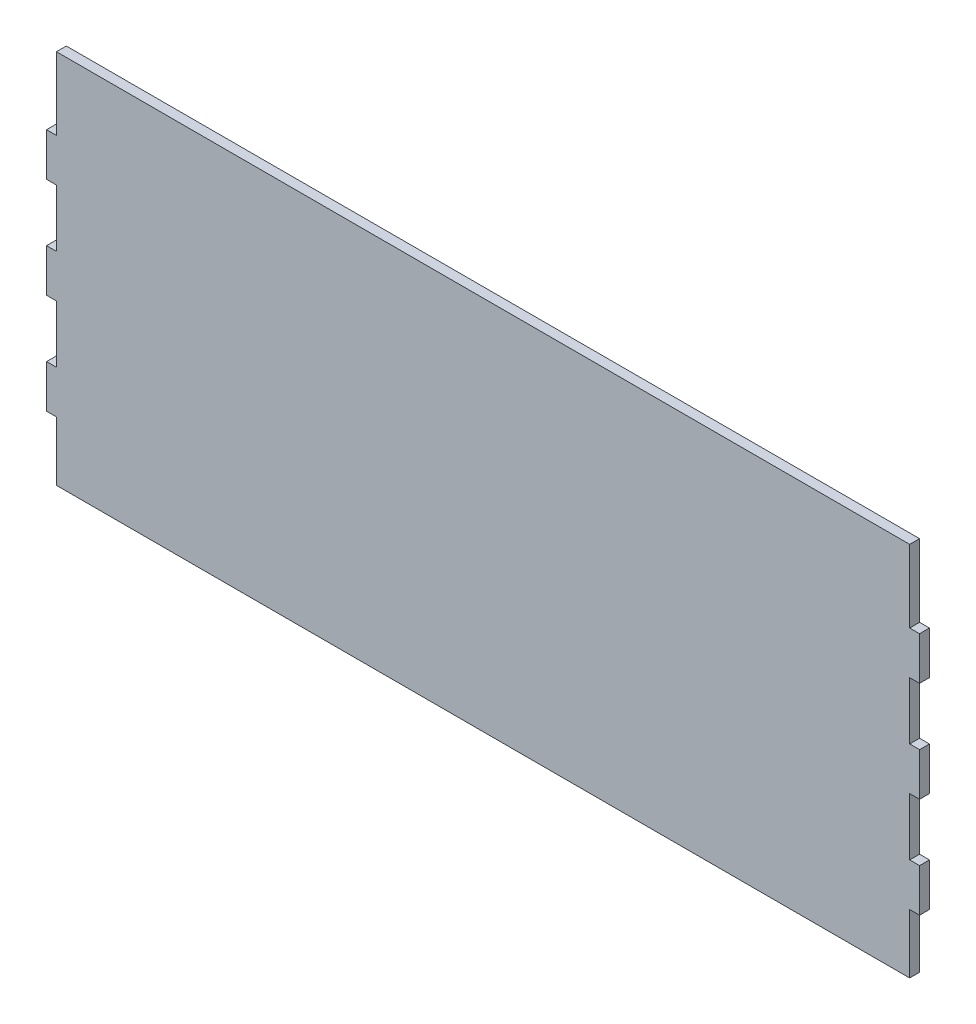
ISO-10303-21;
HEADER;
FILE_DESCRIPTION(('STEP AP214'),'2;1');
FILE_NAME('part.step','',(''),(''),'','','');
FILE_SCHEMA(('AUTOMOTIVE_DESIGN { 1 0 10303 214 1 1 1 1 }'));
ENDSEC;
DATA;
#1=APPLICATION_CONTEXT('core data for automotive mechanical design processes');
#2=APPLICATION_PROTOCOL_DEFINITION('international standard','automotive_design',2000,#1);
#3=PRODUCT_CONTEXT('',#1,'mechanical');
#4=PRODUCT('Part','Part','',(#3));
#5=PRODUCT_RELATED_PRODUCT_CATEGORY('part','',(#4));
#6=PRODUCT_DEFINITION_FORMATION('','',#4);
#7=PRODUCT_DEFINITION_CONTEXT('part definition',#1,'design');
#8=PRODUCT_DEFINITION('design','',#6,#7);
#9=PRODUCT_DEFINITION_SHAPE('','',#8);
#10=(LENGTH_UNIT() NAMED_UNIT(*) SI_UNIT(.MILLI.,.METRE.));
#11=(NAMED_UNIT(*) PLANE_ANGLE_UNIT() SI_UNIT($,.RADIAN.));
#12=(NAMED_UNIT(*) SI_UNIT($,.STERADIAN.) SOLID_ANGLE_UNIT());
#13=UNCERTAINTY_MEASURE_WITH_UNIT(LENGTH_MEASURE(1.E-05),#10,'distance_accuracy_value','');
#14=(GEOMETRIC_REPRESENTATION_CONTEXT(3) GLOBAL_UNCERTAINTY_ASSIGNED_CONTEXT((#13)) GLOBAL_UNIT_ASSIGNED_CONTEXT((#10,
#11,#12)) REPRESENTATION_CONTEXT('',''));
#15=CARTESIAN_POINT('',(0.,0.,0.));
#16=DIRECTION('',(0.,0.,1.));
#17=DIRECTION('',(1.,0.,0.));
#18=AXIS2_PLACEMENT_3D('',#15,#16,#17);
#19=CARTESIAN_POINT('',(132.5,55.,3.));
#20=DIRECTION('',(-1.,0.,0.));
#21=DIRECTION('',(0.,-1.,0.));
#22=AXIS2_PLACEMENT_3D('',#19,#20,#21);
#23=PLANE('',#22);
#24=DIRECTION('',(0.,0.,1.));
#25=VECTOR('',#24,1.);
#26=CARTESIAN_POINT('',(132.5,-23.9518056222649,0.));
#27=LINE('',#26,#25);
#28=CARTESIAN_POINT('',(132.5,-23.9518056222649,0.));
#29=VERTEX_POINT('',#28);
#30=CARTESIAN_POINT('',(132.5,-23.9518056222649,3.));
#31=VERTEX_POINT('',#30);
#32=EDGE_CURVE('E358',#29,#31,#27,.T.);
#33=ORIENTED_EDGE('',*,*,#32,.T.);
#34=DIRECTION('',(0.,1.,0.));
#35=VECTOR('',#34,1.);
#36=CARTESIAN_POINT('',(132.5,55.,3.));
#37=LINE('',#36,#35);
#38=CARTESIAN_POINT('',(132.5,-37.,3.));
#39=VERTEX_POINT('',#38);
#40=EDGE_CURVE('E412',#39,#31,#37,.T.);
#41=ORIENTED_EDGE('',*,*,#40,.F.);
#42=DIRECTION('',(0.,0.,1.));
#43=VECTOR('',#42,1.);
#44=CARTESIAN_POINT('',(132.5,-37.,0.));
#45=LINE('',#44,#43);
#46=CARTESIAN_POINT('',(132.5,-37.,0.));
#47=VERTEX_POINT('',#46);
#48=EDGE_CURVE('E286',#47,#39,#45,.T.);
#49=ORIENTED_EDGE('',*,*,#48,.F.);
#50=DIRECTION('',(0.,1.,0.));
#51=VECTOR('',#50,1.);
#52=CARTESIAN_POINT('',(132.5,55.,0.));
#53=LINE('',#52,#51);
#54=EDGE_CURVE('E419',#47,#29,#53,.T.);
#55=ORIENTED_EDGE('',*,*,#54,.T.);
#56=EDGE_LOOP('',(#33,#41,#49,#55));
#57=FACE_BOUND('',#56,.T.);
#58=ADVANCED_FACE('F38',(#57),#23,.F.);
#59=CARTESIAN_POINT('',(132.5,-6.52409718886751,3.));
#60=VERTEX_POINT('',#59);
#61=CARTESIAN_POINT('',(132.5,6.52409718886757,3.));
#62=VERTEX_POINT('',#61);
#63=EDGE_CURVE('E411',#60,#62,#37,.T.);
#64=ORIENTED_EDGE('',*,*,#63,.F.);
#65=DIRECTION('',(0.,0.,1.));
#66=VECTOR('',#65,1.);
#67=CARTESIAN_POINT('',(132.5,-6.52409718886751,0.));
#68=LINE('',#67,#66);
#69=CARTESIAN_POINT('',(132.5,-6.52409718886751,0.));
#70=VERTEX_POINT('',#69);
#71=EDGE_CURVE('E356',#70,#60,#68,.T.);
#72=ORIENTED_EDGE('',*,*,#71,.F.);
#73=CARTESIAN_POINT('',(132.5,6.52409718886757,0.));
#74=VERTEX_POINT('',#73);
#75=EDGE_CURVE('E418',#70,#74,#53,.T.);
#76=ORIENTED_EDGE('',*,*,#75,.T.);
#77=DIRECTION('',(0.,0.,1.));
#78=VECTOR('',#77,1.);
#79=CARTESIAN_POINT('',(132.5,6.52409718886757,0.));
#80=LINE('',#79,#78);
#81=EDGE_CURVE('E335',#74,#62,#80,.T.);
#82=ORIENTED_EDGE('',*,*,#81,.T.);
#83=EDGE_LOOP('',(#64,#72,#76,#82));
#84=FACE_BOUND('',#83,.T.);
#85=ADVANCED_FACE('F521',(#84),#23,.F.);
#86=CARTESIAN_POINT('',(132.5,23.951805622265,3.));
#87=VERTEX_POINT('',#86);
#88=CARTESIAN_POINT('',(132.5,37.,3.));
#89=VERTEX_POINT('',#88);
#90=EDGE_CURVE('E408',#87,#89,#37,.T.);
#91=ORIENTED_EDGE('',*,*,#90,.F.);
#92=DIRECTION('',(0.,0.,1.));
#93=VECTOR('',#92,1.);
#94=CARTESIAN_POINT('',(132.5,23.951805622265,0.));
#95=LINE('',#94,#93);
#96=CARTESIAN_POINT('',(132.5,23.951805622265,0.));
#97=VERTEX_POINT('',#96);
#98=EDGE_CURVE('E333',#97,#87,#95,.T.);
#99=ORIENTED_EDGE('',*,*,#98,.F.);
#100=CARTESIAN_POINT('',(132.5,37.,0.));
#101=VERTEX_POINT('',#100);
#102=EDGE_CURVE('E406',#97,#101,#53,.T.);
#103=ORIENTED_EDGE('',*,*,#102,.T.);
#104=DIRECTION('',(0.,0.,1.));
#105=VECTOR('',#104,1.);
#106=CARTESIAN_POINT('',(132.5,37.,0.));
#107=LINE('',#106,#105);
#108=EDGE_CURVE('E375',#101,#89,#107,.T.);
#109=ORIENTED_EDGE('',*,*,#108,.T.);
#110=EDGE_LOOP('',(#91,#99,#103,#109));
#111=FACE_BOUND('',#110,.T.);
#112=ADVANCED_FACE('F503',(#111),#23,.F.);
#113=CARTESIAN_POINT('',(-132.5,55.,3.));
#114=DIRECTION('',(1.,0.,0.));
#115=DIRECTION('',(0.,0.,-1.));
#116=AXIS2_PLACEMENT_3D('',#113,#114,#115);
#117=PLANE('',#116);
#118=DIRECTION('',(0.,0.,1.));
#119=VECTOR('',#118,1.);
#120=CARTESIAN_POINT('',(-132.5,23.951805622265,0.));
#121=LINE('',#120,#119);
#122=CARTESIAN_POINT('',(-132.5,23.951805622265,0.));
#123=VERTEX_POINT('',#122);
#124=CARTESIAN_POINT('',(-132.5,23.951805622265,3.));
#125=VERTEX_POINT('',#124);
#126=EDGE_CURVE('E383',#123,#125,#121,.T.);
#127=ORIENTED_EDGE('',*,*,#126,.T.);
#128=DIRECTION('',(0.,-1.,0.));
#129=VECTOR('',#128,1.);
#130=CARTESIAN_POINT('',(-132.5,55.,3.));
#131=LINE('',#130,#129);
#132=CARTESIAN_POINT('',(-132.5,37.,3.));
#133=VERTEX_POINT('',#132);
#134=EDGE_CURVE('E46',#133,#125,#131,.T.);
#135=ORIENTED_EDGE('',*,*,#134,.F.);
#136=DIRECTION('',(0.,0.,1.));
#137=VECTOR('',#136,1.);
#138=CARTESIAN_POINT('',(-132.5,37.,0.));
#139=LINE('',#138,#137);
#140=CARTESIAN_POINT('',(-132.5,37.,0.));
#141=VERTEX_POINT('',#140);
#142=EDGE_CURVE('E402',#141,#133,#139,.T.);
#143=ORIENTED_EDGE('',*,*,#142,.F.);
#144=DIRECTION('',(0.,-1.,0.));
#145=VECTOR('',#144,1.);
#146=CARTESIAN_POINT('',(-132.5,55.,0.));
#147=LINE('',#146,#145);
#148=EDGE_CURVE('E423',#141,#123,#147,.T.);
#149=ORIENTED_EDGE('',*,*,#148,.T.);
#150=EDGE_LOOP('',(#127,#135,#143,#149));
#151=FACE_BOUND('',#150,.T.);
#152=ADVANCED_FACE('F491',(#151),#117,.F.);
#153=DIRECTION('',(0.,0.,1.));
#154=VECTOR('',#153,1.);
#155=CARTESIAN_POINT('',(-132.5,-37.,0.));
#156=LINE('',#155,#154);
#157=CARTESIAN_POINT('',(-132.5,-37.,0.));
#158=VERTEX_POINT('',#157);
#159=CARTESIAN_POINT('',(-132.5,-37.,3.));
#160=VERTEX_POINT('',#159);
#161=EDGE_CURVE('E268',#158,#160,#156,.T.);
#162=ORIENTED_EDGE('',*,*,#161,.T.);
#163=CARTESIAN_POINT('',(-132.5,-23.9518056222649,3.));
#164=VERTEX_POINT('',#163);
#165=EDGE_CURVE('E413',#164,#160,#131,.T.);
#166=ORIENTED_EDGE('',*,*,#165,.F.);
#167=DIRECTION('',(0.,0.,1.));
#168=VECTOR('',#167,1.);
#169=CARTESIAN_POINT('',(-132.5,-23.9518056222649,0.));
#170=LINE('',#169,#168);
#171=CARTESIAN_POINT('',(-132.5,-23.9518056222649,0.));
#172=VERTEX_POINT('',#171);
#173=EDGE_CURVE('E307',#172,#164,#170,.T.);
#174=ORIENTED_EDGE('',*,*,#173,.F.);
#175=EDGE_CURVE('E420',#172,#158,#147,.T.);
#176=ORIENTED_EDGE('',*,*,#175,.T.);
#177=EDGE_LOOP('',(#162,#166,#174,#176));
#178=FACE_BOUND('',#177,.T.);
#179=ADVANCED_FACE('F464',(#178),#117,.F.);
#180=CARTESIAN_POINT('',(-132.5,6.52409718886757,3.));
#181=VERTEX_POINT('',#180);
#182=CARTESIAN_POINT('',(-132.5,-6.52409718886751,3.));
#183=VERTEX_POINT('',#182);
#184=EDGE_CURVE('E415',#181,#183,#131,.T.);
#185=ORIENTED_EDGE('',*,*,#184,.F.);
#186=DIRECTION('',(0.,0.,1.));
#187=VECTOR('',#186,1.);
#188=CARTESIAN_POINT('',(-132.5,6.52409718886757,0.));
#189=LINE('',#188,#187);
#190=CARTESIAN_POINT('',(-132.5,6.52409718886757,0.));
#191=VERTEX_POINT('',#190);
#192=EDGE_CURVE('E381',#191,#181,#189,.T.);
#193=ORIENTED_EDGE('',*,*,#192,.F.);
#194=CARTESIAN_POINT('',(-132.5,-6.52409718886751,0.));
#195=VERTEX_POINT('',#194);
#196=EDGE_CURVE('E422',#191,#195,#147,.T.);
#197=ORIENTED_EDGE('',*,*,#196,.T.);
#198=DIRECTION('',(0.,0.,1.));
#199=VECTOR('',#198,1.);
#200=CARTESIAN_POINT('',(-132.5,-6.52409718886751,0.));
#201=LINE('',#200,#199);
#202=EDGE_CURVE('E309',#195,#183,#201,.T.);
#203=ORIENTED_EDGE('',*,*,#202,.T.);
#204=EDGE_LOOP('',(#185,#193,#197,#203));
#205=FACE_BOUND('',#204,.T.);
#206=ADVANCED_FACE('F476',(#205),#117,.F.);
#207=CARTESIAN_POINT('',(-132.5,-55.,3.));
#208=DIRECTION('',(0.,1.,0.));
#209=DIRECTION('',(0.,0.,1.));
#210=AXIS2_PLACEMENT_3D('',#207,#208,#209);
#211=PLANE('',#210);
#212=DIRECTION('',(0.,0.,1.));
#213=VECTOR('',#212,1.);
#214=CARTESIAN_POINT('',(-129.5,-55.,0.));
#215=LINE('',#214,#213);
#216=CARTESIAN_POINT('',(-129.5,-55.,0.));
#217=VERTEX_POINT('',#216);
#218=CARTESIAN_POINT('',(-129.5,-55.,3.));
#219=VERTEX_POINT('',#218);
#220=EDGE_CURVE('E265',#217,#219,#215,.T.);
#221=ORIENTED_EDGE('',*,*,#220,.F.);
#222=DIRECTION('',(1.,0.,0.));
#223=VECTOR('',#222,1.);
#224=CARTESIAN_POINT('',(-132.5,-55.,0.));
#225=LINE('',#224,#223);
#226=CARTESIAN_POINT('',(129.5,-55.,0.));
#227=VERTEX_POINT('',#226);
#228=EDGE_CURVE('E41',#217,#227,#225,.T.);
#229=ORIENTED_EDGE('',*,*,#228,.T.);
#230=DIRECTION('',(0.,0.,1.));
#231=VECTOR('',#230,1.);
#232=CARTESIAN_POINT('',(129.5,-55.,0.));
#233=LINE('',#232,#231);
#234=CARTESIAN_POINT('',(129.5,-55.,3.));
#235=VERTEX_POINT('',#234);
#236=EDGE_CURVE('E278',#227,#235,#233,.T.);
#237=ORIENTED_EDGE('',*,*,#236,.T.);
#238=DIRECTION('',(1.,0.,0.));
#239=VECTOR('',#238,1.);
#240=CARTESIAN_POINT('',(-132.5,-55.,3.));
#241=LINE('',#240,#239);
#242=EDGE_CURVE('E11',#219,#235,#241,.T.);
#243=ORIENTED_EDGE('',*,*,#242,.F.);
#244=EDGE_LOOP('',(#221,#229,#237,#243));
#245=FACE_BOUND('',#244,.T.);
#246=ADVANCED_FACE('F437',(#245),#211,.F.);
#247=CARTESIAN_POINT('',(0.,0.,3.));
#248=DIRECTION('',(0.,0.,1.));
#249=DIRECTION('',(1.,0.,0.));
#250=AXIS2_PLACEMENT_3D('',#247,#248,#249);
#251=PLANE('',#250);
#252=DIRECTION('',(-1.,0.,0.));
#253=VECTOR('',#252,1.);
#254=CARTESIAN_POINT('',(0.,-6.52409718886751,3.));
#255=LINE('',#254,#253);
#256=CARTESIAN_POINT('',(129.5,-6.52409718886751,3.));
#257=VERTEX_POINT('',#256);
#258=EDGE_CURVE('E342',#60,#257,#255,.T.);
#259=ORIENTED_EDGE('',*,*,#258,.F.);
#260=ORIENTED_EDGE('',*,*,#63,.T.);
#261=DIRECTION('',(-1.,0.,0.));
#262=VECTOR('',#261,1.);
#263=CARTESIAN_POINT('',(0.,6.52409718886757,3.));
#264=LINE('',#263,#262);
#265=CARTESIAN_POINT('',(129.5,6.52409718886757,3.));
#266=VERTEX_POINT('',#265);
#267=EDGE_CURVE('E325',#62,#266,#264,.T.);
#268=ORIENTED_EDGE('',*,*,#267,.T.);
#269=DIRECTION('',(0.,1.,0.));
#270=VECTOR('',#269,1.);
#271=CARTESIAN_POINT('',(129.5,0.,3.));
#272=LINE('',#271,#270);
#273=CARTESIAN_POINT('',(129.5,23.951805622265,3.));
#274=VERTEX_POINT('',#273);
#275=EDGE_CURVE('E322',#266,#274,#272,.T.);
#276=ORIENTED_EDGE('',*,*,#275,.T.);
#277=DIRECTION('',(-1.,0.,0.));
#278=VECTOR('',#277,1.);
#279=CARTESIAN_POINT('',(0.,23.951805622265,3.));
#280=LINE('',#279,#278);
#281=EDGE_CURVE('E316',#87,#274,#280,.T.);
#282=ORIENTED_EDGE('',*,*,#281,.F.);
#283=ORIENTED_EDGE('',*,*,#90,.T.);
#284=DIRECTION('',(-1.,0.,0.));
#285=VECTOR('',#284,1.);
#286=CARTESIAN_POINT('',(0.,37.,3.));
#287=LINE('',#286,#285);
#288=CARTESIAN_POINT('',(129.5,37.,3.));
#289=VERTEX_POINT('',#288);
#290=EDGE_CURVE('E390',#89,#289,#287,.T.);
#291=ORIENTED_EDGE('',*,*,#290,.T.);
#292=DIRECTION('',(0.,1.,0.));
#293=VECTOR('',#292,1.);
#294=CARTESIAN_POINT('',(129.5,0.,3.));
#295=LINE('',#294,#293);
#296=CARTESIAN_POINT('',(129.5,59.,3.));
#297=VERTEX_POINT('',#296);
#298=EDGE_CURVE('E248',#289,#297,#295,.T.);
#299=ORIENTED_EDGE('',*,*,#298,.T.);
#300=DIRECTION('',(1.,0.,0.));
#301=VECTOR('',#300,1.);
#302=CARTESIAN_POINT('',(129.5,59.,3.));
#303=LINE('',#302,#301);
#304=CARTESIAN_POINT('',(-129.5,59.,3.));
#305=VERTEX_POINT('',#304);
#306=EDGE_CURVE('E239',#305,#297,#303,.T.);
#307=ORIENTED_EDGE('',*,*,#306,.F.);
#308=DIRECTION('',(0.,-1.,0.));
#309=VECTOR('',#308,1.);
#310=CARTESIAN_POINT('',(-129.5,0.,3.));
#311=LINE('',#310,#309);
#312=CARTESIAN_POINT('',(-129.5,37.,3.));
#313=VERTEX_POINT('',#312);
#314=EDGE_CURVE('E224',#305,#313,#311,.T.);
#315=ORIENTED_EDGE('',*,*,#314,.T.);
#316=DIRECTION('',(1.,0.,0.));
#317=VECTOR('',#316,1.);
#318=CARTESIAN_POINT('',(0.,37.,3.));
#319=LINE('',#318,#317);
#320=EDGE_CURVE('E232',#133,#313,#319,.T.);
#321=ORIENTED_EDGE('',*,*,#320,.F.);
#322=ORIENTED_EDGE('',*,*,#134,.T.);
#323=DIRECTION('',(1.,0.,0.));
#324=VECTOR('',#323,1.);
#325=CARTESIAN_POINT('',(0.,23.951805622265,3.));
#326=LINE('',#325,#324);
#327=CARTESIAN_POINT('',(-129.5,23.951805622265,3.));
#328=VERTEX_POINT('',#327);
#329=EDGE_CURVE('E374',#125,#328,#326,.T.);
#330=ORIENTED_EDGE('',*,*,#329,.T.);
#331=DIRECTION('',(0.,-1.,0.));
#332=VECTOR('',#331,1.);
#333=CARTESIAN_POINT('',(-129.5,0.,3.));
#334=LINE('',#333,#332);
#335=CARTESIAN_POINT('',(-129.5,6.52409718886757,3.));
#336=VERTEX_POINT('',#335);
#337=EDGE_CURVE('E371',#328,#336,#334,.T.);
#338=ORIENTED_EDGE('',*,*,#337,.T.);
#339=DIRECTION('',(1.,0.,0.));
#340=VECTOR('',#339,1.);
#341=CARTESIAN_POINT('',(0.,6.52409718886757,3.));
#342=LINE('',#341,#340);
#343=EDGE_CURVE('E365',#181,#336,#342,.T.);
#344=ORIENTED_EDGE('',*,*,#343,.F.);
#345=ORIENTED_EDGE('',*,*,#184,.T.);
#346=DIRECTION('',(1.,0.,0.));
#347=VECTOR('',#346,1.);
#348=CARTESIAN_POINT('',(0.,-6.52409718886751,3.));
#349=LINE('',#348,#347);
#350=CARTESIAN_POINT('',(-129.5,-6.52409718886751,3.));
#351=VERTEX_POINT('',#350);
#352=EDGE_CURVE('E301',#183,#351,#349,.T.);
#353=ORIENTED_EDGE('',*,*,#352,.T.);
#354=DIRECTION('',(0.,-1.,0.));
#355=VECTOR('',#354,1.);
#356=CARTESIAN_POINT('',(-129.5,0.,3.));
#357=LINE('',#356,#355);
#358=CARTESIAN_POINT('',(-129.5,-23.9518056222649,3.));
#359=VERTEX_POINT('',#358);
#360=EDGE_CURVE('E267',#351,#359,#357,.T.);
#361=ORIENTED_EDGE('',*,*,#360,.T.);
#362=DIRECTION('',(1.,0.,0.));
#363=VECTOR('',#362,1.);
#364=CARTESIAN_POINT('',(0.,-23.9518056222649,3.));
#365=LINE('',#364,#363);
#366=EDGE_CURVE('E293',#164,#359,#365,.T.);
#367=ORIENTED_EDGE('',*,*,#366,.F.);
#368=ORIENTED_EDGE('',*,*,#165,.T.);
#369=DIRECTION('',(1.,0.,0.));
#370=VECTOR('',#369,1.);
#371=CARTESIAN_POINT('',(0.,-37.,3.));
#372=LINE('',#371,#370);
#373=CARTESIAN_POINT('',(-129.5,-37.,3.));
#374=VERTEX_POINT('',#373);
#375=EDGE_CURVE('E258',#160,#374,#372,.T.);
#376=ORIENTED_EDGE('',*,*,#375,.T.);
#377=DIRECTION('',(0.,-1.,0.));
#378=VECTOR('',#377,1.);
#379=CARTESIAN_POINT('',(-129.5,0.,3.));
#380=LINE('',#379,#378);
#381=EDGE_CURVE('E253',#374,#219,#380,.T.);
#382=ORIENTED_EDGE('',*,*,#381,.T.);
#383=ORIENTED_EDGE('',*,*,#242,.T.);
#384=DIRECTION('',(0.,1.,0.));
#385=VECTOR('',#384,1.);
#386=CARTESIAN_POINT('',(129.5,-7.1886940844479E-13,3.));
#387=LINE('',#386,#385);
#388=CARTESIAN_POINT('',(129.5,-37.,3.));
#389=VERTEX_POINT('',#388);
#390=EDGE_CURVE('E279',#235,#389,#387,.T.);
#391=ORIENTED_EDGE('',*,*,#390,.T.);
#392=DIRECTION('',(-1.,0.,0.));
#393=VECTOR('',#392,1.);
#394=CARTESIAN_POINT('',(0.,-37.,3.));
#395=LINE('',#394,#393);
#396=EDGE_CURVE('E275',#39,#389,#395,.T.);
#397=ORIENTED_EDGE('',*,*,#396,.F.);
#398=ORIENTED_EDGE('',*,*,#40,.T.);
#399=DIRECTION('',(-1.,0.,0.));
#400=VECTOR('',#399,1.);
#401=CARTESIAN_POINT('',(0.,-23.9518056222649,3.));
#402=LINE('',#401,#400);
#403=CARTESIAN_POINT('',(129.5,-23.9518056222649,3.));
#404=VERTEX_POINT('',#403);
#405=EDGE_CURVE('E350',#31,#404,#402,.T.);
#406=ORIENTED_EDGE('',*,*,#405,.T.);
#407=DIRECTION('',(0.,1.,0.));
#408=VECTOR('',#407,1.);
#409=CARTESIAN_POINT('',(129.5,0.,3.));
#410=LINE('',#409,#408);
#411=EDGE_CURVE('E285',#404,#257,#410,.T.);
#412=ORIENTED_EDGE('',*,*,#411,.T.);
#413=EDGE_LOOP('',(#259,#260,#268,#276,#282,#283,#291,#299,#307,#315,#321,#322,#330,#338,#344,
#345,#353,#361,#367,#368,#376,#382,#383,#391,#397,#398,#406,#412));
#414=FACE_BOUND('',#413,.T.);
#415=ADVANCED_FACE('F245',(#414),#251,.T.);
#416=CARTESIAN_POINT('',(0.,0.,0.));
#417=DIRECTION('',(0.,0.,1.));
#418=DIRECTION('',(1.,0.,0.));
#419=AXIS2_PLACEMENT_3D('',#416,#417,#418);
#420=PLANE('',#419);
#421=ORIENTED_EDGE('',*,*,#75,.F.);
#422=DIRECTION('',(-1.,0.,0.));
#423=VECTOR('',#422,1.);
#424=CARTESIAN_POINT('',(0.,-6.52409718886751,0.));
#425=LINE('',#424,#423);
#426=CARTESIAN_POINT('',(129.5,-6.52409718886751,0.));
#427=VERTEX_POINT('',#426);
#428=EDGE_CURVE('E344',#70,#427,#425,.T.);
#429=ORIENTED_EDGE('',*,*,#428,.T.);
#430=DIRECTION('',(0.,1.,0.));
#431=VECTOR('',#430,1.);
#432=CARTESIAN_POINT('',(129.5,0.,0.));
#433=LINE('',#432,#431);
#434=CARTESIAN_POINT('',(129.5,-23.9518056222649,0.));
#435=VERTEX_POINT('',#434);
#436=EDGE_CURVE('E339',#435,#427,#433,.T.);
#437=ORIENTED_EDGE('',*,*,#436,.F.);
#438=DIRECTION('',(-1.,0.,0.));
#439=VECTOR('',#438,1.);
#440=CARTESIAN_POINT('',(0.,-23.9518056222649,0.));
#441=LINE('',#440,#439);
#442=EDGE_CURVE('E341',#29,#435,#441,.T.);
#443=ORIENTED_EDGE('',*,*,#442,.F.);
#444=ORIENTED_EDGE('',*,*,#54,.F.);
#445=DIRECTION('',(-1.,0.,0.));
#446=VECTOR('',#445,1.);
#447=CARTESIAN_POINT('',(0.,-37.,0.));
#448=LINE('',#447,#446);
#449=CARTESIAN_POINT('',(129.5,-37.,0.));
#450=VERTEX_POINT('',#449);
#451=EDGE_CURVE('E274',#47,#450,#448,.T.);
#452=ORIENTED_EDGE('',*,*,#451,.T.);
#453=DIRECTION('',(0.,1.,0.));
#454=VECTOR('',#453,1.);
#455=CARTESIAN_POINT('',(129.5,-7.1886940844479E-13,0.));
#456=LINE('',#455,#454);
#457=EDGE_CURVE('E272',#227,#450,#456,.T.);
#458=ORIENTED_EDGE('',*,*,#457,.F.);
#459=ORIENTED_EDGE('',*,*,#228,.F.);
#460=DIRECTION('',(0.,-1.,0.));
#461=VECTOR('',#460,1.);
#462=CARTESIAN_POINT('',(-129.5,0.,0.));
#463=LINE('',#462,#461);
#464=CARTESIAN_POINT('',(-129.5,-37.,0.));
#465=VERTEX_POINT('',#464);
#466=EDGE_CURVE('E255',#465,#217,#463,.T.);
#467=ORIENTED_EDGE('',*,*,#466,.F.);
#468=DIRECTION('',(1.,0.,0.));
#469=VECTOR('',#468,1.);
#470=CARTESIAN_POINT('',(0.,-37.,0.));
#471=LINE('',#470,#469);
#472=EDGE_CURVE('E257',#158,#465,#471,.T.);
#473=ORIENTED_EDGE('',*,*,#472,.F.);
#474=ORIENTED_EDGE('',*,*,#175,.F.);
#475=DIRECTION('',(1.,0.,0.));
#476=VECTOR('',#475,1.);
#477=CARTESIAN_POINT('',(0.,-23.9518056222649,0.));
#478=LINE('',#477,#476);
#479=CARTESIAN_POINT('',(-129.5,-23.9518056222649,0.));
#480=VERTEX_POINT('',#479);
#481=EDGE_CURVE('E295',#172,#480,#478,.T.);
#482=ORIENTED_EDGE('',*,*,#481,.T.);
#483=DIRECTION('',(0.,-1.,0.));
#484=VECTOR('',#483,1.);
#485=CARTESIAN_POINT('',(-129.5,0.,0.));
#486=LINE('',#485,#484);
#487=CARTESIAN_POINT('',(-129.5,-6.52409718886751,0.));
#488=VERTEX_POINT('',#487);
#489=EDGE_CURVE('E290',#488,#480,#486,.T.);
#490=ORIENTED_EDGE('',*,*,#489,.F.);
#491=DIRECTION('',(1.,0.,0.));
#492=VECTOR('',#491,1.);
#493=CARTESIAN_POINT('',(0.,-6.52409718886751,0.));
#494=LINE('',#493,#492);
#495=EDGE_CURVE('E292',#195,#488,#494,.T.);
#496=ORIENTED_EDGE('',*,*,#495,.F.);
#497=ORIENTED_EDGE('',*,*,#196,.F.);
#498=DIRECTION('',(1.,0.,0.));
#499=VECTOR('',#498,1.);
#500=CARTESIAN_POINT('',(0.,6.52409718886757,0.));
#501=LINE('',#500,#499);
#502=CARTESIAN_POINT('',(-129.5,6.52409718886757,0.));
#503=VERTEX_POINT('',#502);
#504=EDGE_CURVE('E367',#191,#503,#501,.T.);
#505=ORIENTED_EDGE('',*,*,#504,.T.);
#506=DIRECTION('',(0.,-1.,0.));
#507=VECTOR('',#506,1.);
#508=CARTESIAN_POINT('',(-129.5,0.,0.));
#509=LINE('',#508,#507);
#510=CARTESIAN_POINT('',(-129.5,23.951805622265,0.));
#511=VERTEX_POINT('',#510);
#512=EDGE_CURVE('E362',#511,#503,#509,.T.);
#513=ORIENTED_EDGE('',*,*,#512,.F.);
#514=DIRECTION('',(1.,0.,0.));
#515=VECTOR('',#514,1.);
#516=CARTESIAN_POINT('',(0.,23.951805622265,0.));
#517=LINE('',#516,#515);
#518=EDGE_CURVE('E364',#123,#511,#517,.T.);
#519=ORIENTED_EDGE('',*,*,#518,.F.);
#520=ORIENTED_EDGE('',*,*,#148,.F.);
#521=DIRECTION('',(1.,0.,0.));
#522=VECTOR('',#521,1.);
#523=CARTESIAN_POINT('',(0.,37.,0.));
#524=LINE('',#523,#522);
#525=CARTESIAN_POINT('',(-129.5,37.,0.));
#526=VERTEX_POINT('',#525);
#527=EDGE_CURVE('E400',#141,#526,#524,.T.);
#528=ORIENTED_EDGE('',*,*,#527,.T.);
#529=DIRECTION('',(0.,-1.,0.));
#530=VECTOR('',#529,1.);
#531=CARTESIAN_POINT('',(-129.5,0.,0.));
#532=LINE('',#531,#530);
#533=CARTESIAN_POINT('',(-129.5,59.,0.));
#534=VERTEX_POINT('',#533);
#535=EDGE_CURVE('E398',#534,#526,#532,.T.);
#536=ORIENTED_EDGE('',*,*,#535,.F.);
#537=DIRECTION('',(1.,0.,0.));
#538=VECTOR('',#537,1.);
#539=CARTESIAN_POINT('',(129.5,59.,0.));
#540=LINE('',#539,#538);
#541=CARTESIAN_POINT('',(129.5,59.,0.));
#542=VERTEX_POINT('',#541);
#543=EDGE_CURVE('E241',#534,#542,#540,.T.);
#544=ORIENTED_EDGE('',*,*,#543,.T.);
#545=DIRECTION('',(0.,1.,0.));
#546=VECTOR('',#545,1.);
#547=CARTESIAN_POINT('',(129.5,0.,0.));
#548=LINE('',#547,#546);
#549=CARTESIAN_POINT('',(129.5,37.,0.));
#550=VERTEX_POINT('',#549);
#551=EDGE_CURVE('E387',#550,#542,#548,.T.);
#552=ORIENTED_EDGE('',*,*,#551,.F.);
#553=DIRECTION('',(-1.,0.,0.));
#554=VECTOR('',#553,1.);
#555=CARTESIAN_POINT('',(0.,37.,0.));
#556=LINE('',#555,#554);
#557=EDGE_CURVE('E389',#101,#550,#556,.T.);
#558=ORIENTED_EDGE('',*,*,#557,.F.);
#559=ORIENTED_EDGE('',*,*,#102,.F.);
#560=DIRECTION('',(-1.,0.,0.));
#561=VECTOR('',#560,1.);
#562=CARTESIAN_POINT('',(0.,23.951805622265,0.));
#563=LINE('',#562,#561);
#564=CARTESIAN_POINT('',(129.5,23.951805622265,0.));
#565=VERTEX_POINT('',#564);
#566=EDGE_CURVE('E318',#97,#565,#563,.T.);
#567=ORIENTED_EDGE('',*,*,#566,.T.);
#568=DIRECTION('',(0.,1.,0.));
#569=VECTOR('',#568,1.);
#570=CARTESIAN_POINT('',(129.5,0.,0.));
#571=LINE('',#570,#569);
#572=CARTESIAN_POINT('',(129.5,6.52409718886757,0.));
#573=VERTEX_POINT('',#572);
#574=EDGE_CURVE('E313',#573,#565,#571,.T.);
#575=ORIENTED_EDGE('',*,*,#574,.F.);
#576=DIRECTION('',(-1.,0.,0.));
#577=VECTOR('',#576,1.);
#578=CARTESIAN_POINT('',(0.,6.52409718886757,0.));
#579=LINE('',#578,#577);
#580=EDGE_CURVE('E315',#74,#573,#579,.T.);
#581=ORIENTED_EDGE('',*,*,#580,.F.);
#582=EDGE_LOOP('',(#421,#429,#437,#443,#444,#452,#458,#459,#467,#473,#474,#482,#490,#496,#497,
#505,#513,#519,#520,#528,#536,#544,#552,#558,#559,#567,#575,#581));
#583=FACE_BOUND('',#582,.T.);
#584=ADVANCED_FACE('F443',(#583),#420,.F.);
#585=CARTESIAN_POINT('',(-129.5,0.,0.));
#586=DIRECTION('',(-1.,0.,0.));
#587=DIRECTION('',(0.,0.,1.));
#588=AXIS2_PLACEMENT_3D('',#585,#586,#587);
#589=PLANE('',#588);
#590=ORIENTED_EDGE('',*,*,#314,.F.);
#591=DIRECTION('',(0.,0.,-1.));
#592=VECTOR('',#591,1.);
#593=CARTESIAN_POINT('',(-129.5,59.,3.));
#594=LINE('',#593,#592);
#595=EDGE_CURVE('E227',#305,#534,#594,.T.);
#596=ORIENTED_EDGE('',*,*,#595,.T.);
#597=ORIENTED_EDGE('',*,*,#535,.T.);
#598=DIRECTION('',(0.,0.,1.));
#599=VECTOR('',#598,1.);
#600=CARTESIAN_POINT('',(-129.5,37.,0.));
#601=LINE('',#600,#599);
#602=EDGE_CURVE('E62',#526,#313,#601,.T.);
#603=ORIENTED_EDGE('',*,*,#602,.T.);
#604=EDGE_LOOP('',(#590,#596,#597,#603));
#605=FACE_BOUND('',#604,.T.);
#606=ADVANCED_FACE('F226',(#605),#589,.T.);
#607=CARTESIAN_POINT('',(0.,37.,0.));
#608=DIRECTION('',(0.,-1.,0.));
#609=DIRECTION('',(0.,0.,-1.));
#610=AXIS2_PLACEMENT_3D('',#607,#608,#609);
#611=PLANE('',#610);
#612=ORIENTED_EDGE('',*,*,#320,.T.);
#613=ORIENTED_EDGE('',*,*,#602,.F.);
#614=ORIENTED_EDGE('',*,*,#527,.F.);
#615=ORIENTED_EDGE('',*,*,#142,.T.);
#616=EDGE_LOOP('',(#612,#613,#614,#615));
#617=FACE_BOUND('',#616,.T.);
#618=ADVANCED_FACE('F492',(#617),#611,.F.);
#619=CARTESIAN_POINT('',(129.5,-7.1886940844479E-13,0.));
#620=DIRECTION('',(1.,0.,0.));
#621=DIRECTION('',(0.,1.,0.));
#622=AXIS2_PLACEMENT_3D('',#619,#620,#621);
#623=PLANE('',#622);
#624=ORIENTED_EDGE('',*,*,#390,.F.);
#625=ORIENTED_EDGE('',*,*,#236,.F.);
#626=ORIENTED_EDGE('',*,*,#457,.T.);
#627=DIRECTION('',(0.,0.,1.));
#628=VECTOR('',#627,1.);
#629=CARTESIAN_POINT('',(129.5,-37.,0.));
#630=LINE('',#629,#628);
#631=EDGE_CURVE('E54',#450,#389,#630,.T.);
#632=ORIENTED_EDGE('',*,*,#631,.T.);
#633=EDGE_LOOP('',(#624,#625,#626,#632));
#634=FACE_BOUND('',#633,.T.);
#635=ADVANCED_FACE('F447',(#634),#623,.T.);
#636=CARTESIAN_POINT('',(0.,-37.,0.));
#637=DIRECTION('',(0.,1.,0.));
#638=DIRECTION('',(0.,0.,1.));
#639=AXIS2_PLACEMENT_3D('',#636,#637,#638);
#640=PLANE('',#639);
#641=ORIENTED_EDGE('',*,*,#396,.T.);
#642=ORIENTED_EDGE('',*,*,#631,.F.);
#643=ORIENTED_EDGE('',*,*,#451,.F.);
#644=ORIENTED_EDGE('',*,*,#48,.T.);
#645=EDGE_LOOP('',(#641,#642,#643,#644));
#646=FACE_BOUND('',#645,.T.);
#647=ADVANCED_FACE('F680',(#646),#640,.F.);
#648=CARTESIAN_POINT('',(-129.5,0.,0.));
#649=DIRECTION('',(-1.,0.,0.));
#650=DIRECTION('',(0.,0.,1.));
#651=AXIS2_PLACEMENT_3D('',#648,#649,#650);
#652=PLANE('',#651);
#653=ORIENTED_EDGE('',*,*,#360,.F.);
#654=DIRECTION('',(0.,0.,1.));
#655=VECTOR('',#654,1.);
#656=CARTESIAN_POINT('',(-129.5,-6.52409718886751,0.));
#657=LINE('',#656,#655);
#658=EDGE_CURVE('E298',#488,#351,#657,.T.);
#659=ORIENTED_EDGE('',*,*,#658,.F.);
#660=ORIENTED_EDGE('',*,*,#489,.T.);
#661=DIRECTION('',(0.,0.,1.));
#662=VECTOR('',#661,1.);
#663=CARTESIAN_POINT('',(-129.5,-23.9518056222649,0.));
#664=LINE('',#663,#662);
#665=EDGE_CURVE('E282',#480,#359,#664,.T.);
#666=ORIENTED_EDGE('',*,*,#665,.T.);
#667=EDGE_LOOP('',(#653,#659,#660,#666));
#668=FACE_BOUND('',#667,.T.);
#669=ADVANCED_FACE('F469',(#668),#652,.T.);
#670=CARTESIAN_POINT('',(0.,-23.9518056222649,0.));
#671=DIRECTION('',(0.,-1.,0.));
#672=DIRECTION('',(0.,0.,-1.));
#673=AXIS2_PLACEMENT_3D('',#670,#671,#672);
#674=PLANE('',#673);
#675=ORIENTED_EDGE('',*,*,#366,.T.);
#676=ORIENTED_EDGE('',*,*,#665,.F.);
#677=ORIENTED_EDGE('',*,*,#481,.F.);
#678=ORIENTED_EDGE('',*,*,#173,.T.);
#679=EDGE_LOOP('',(#675,#676,#677,#678));
#680=FACE_BOUND('',#679,.T.);
#681=ADVANCED_FACE('F461',(#680),#674,.F.);
#682=CARTESIAN_POINT('',(0.,-6.52409718886751,0.));
#683=DIRECTION('',(0.,-1.,0.));
#684=DIRECTION('',(0.,0.,-1.));
#685=AXIS2_PLACEMENT_3D('',#682,#683,#684);
#686=PLANE('',#685);
#687=ORIENTED_EDGE('',*,*,#352,.F.);
#688=ORIENTED_EDGE('',*,*,#202,.F.);
#689=ORIENTED_EDGE('',*,*,#495,.T.);
#690=ORIENTED_EDGE('',*,*,#658,.T.);
#691=EDGE_LOOP('',(#687,#688,#689,#690));
#692=FACE_BOUND('',#691,.T.);
#693=ADVANCED_FACE('F471',(#692),#686,.T.);
#694=CARTESIAN_POINT('',(-129.5,0.,0.));
#695=DIRECTION('',(-1.,0.,0.));
#696=DIRECTION('',(0.,0.,1.));
#697=AXIS2_PLACEMENT_3D('',#694,#695,#696);
#698=PLANE('',#697);
#699=ORIENTED_EDGE('',*,*,#381,.F.);
#700=DIRECTION('',(0.,0.,1.));
#701=VECTOR('',#700,1.);
#702=CARTESIAN_POINT('',(-129.5,-37.,0.));
#703=LINE('',#702,#701);
#704=EDGE_CURVE('E260',#465,#374,#703,.T.);
#705=ORIENTED_EDGE('',*,*,#704,.F.);
#706=ORIENTED_EDGE('',*,*,#466,.T.);
#707=ORIENTED_EDGE('',*,*,#220,.T.);
#708=EDGE_LOOP('',(#699,#705,#706,#707));
#709=FACE_BOUND('',#708,.T.);
#710=ADVANCED_FACE('F454',(#709),#698,.T.);
#711=CARTESIAN_POINT('',(0.,-37.,0.));
#712=DIRECTION('',(0.,-1.,0.));
#713=DIRECTION('',(0.,0.,-1.));
#714=AXIS2_PLACEMENT_3D('',#711,#712,#713);
#715=PLANE('',#714);
#716=ORIENTED_EDGE('',*,*,#375,.F.);
#717=ORIENTED_EDGE('',*,*,#161,.F.);
#718=ORIENTED_EDGE('',*,*,#472,.T.);
#719=ORIENTED_EDGE('',*,*,#704,.T.);
#720=EDGE_LOOP('',(#716,#717,#718,#719));
#721=FACE_BOUND('',#720,.T.);
#722=ADVANCED_FACE('F456',(#721),#715,.T.);
#723=CARTESIAN_POINT('',(-129.5,0.,0.));
#724=DIRECTION('',(-1.,0.,0.));
#725=DIRECTION('',(0.,0.,1.));
#726=AXIS2_PLACEMENT_3D('',#723,#724,#725);
#727=PLANE('',#726);
#728=ORIENTED_EDGE('',*,*,#337,.F.);
#729=DIRECTION('',(0.,0.,1.));
#730=VECTOR('',#729,1.);
#731=CARTESIAN_POINT('',(-129.5,23.951805622265,0.));
#732=LINE('',#731,#730);
#733=EDGE_CURVE('E370',#511,#328,#732,.T.);
#734=ORIENTED_EDGE('',*,*,#733,.F.);
#735=ORIENTED_EDGE('',*,*,#512,.T.);
#736=DIRECTION('',(0.,0.,1.));
#737=VECTOR('',#736,1.);
#738=CARTESIAN_POINT('',(-129.5,6.52409718886757,0.));
#739=LINE('',#738,#737);
#740=EDGE_CURVE('E233',#503,#336,#739,.T.);
#741=ORIENTED_EDGE('',*,*,#740,.T.);
#742=EDGE_LOOP('',(#728,#734,#735,#741));
#743=FACE_BOUND('',#742,.T.);
#744=ADVANCED_FACE('F485',(#743),#727,.T.);
#745=CARTESIAN_POINT('',(0.,6.52409718886757,0.));
#746=DIRECTION('',(0.,-1.,0.));
#747=DIRECTION('',(0.,0.,-1.));
#748=AXIS2_PLACEMENT_3D('',#745,#746,#747);
#749=PLANE('',#748);
#750=ORIENTED_EDGE('',*,*,#343,.T.);
#751=ORIENTED_EDGE('',*,*,#740,.F.);
#752=ORIENTED_EDGE('',*,*,#504,.F.);
#753=ORIENTED_EDGE('',*,*,#192,.T.);
#754=EDGE_LOOP('',(#750,#751,#752,#753));
#755=FACE_BOUND('',#754,.T.);
#756=ADVANCED_FACE('F479',(#755),#749,.F.);
#757=CARTESIAN_POINT('',(0.,23.951805622265,0.));
#758=DIRECTION('',(0.,-1.,0.));
#759=DIRECTION('',(0.,0.,-1.));
#760=AXIS2_PLACEMENT_3D('',#757,#758,#759);
#761=PLANE('',#760);
#762=ORIENTED_EDGE('',*,*,#329,.F.);
#763=ORIENTED_EDGE('',*,*,#126,.F.);
#764=ORIENTED_EDGE('',*,*,#518,.T.);
#765=ORIENTED_EDGE('',*,*,#733,.T.);
#766=EDGE_LOOP('',(#762,#763,#764,#765));
#767=FACE_BOUND('',#766,.T.);
#768=ADVANCED_FACE('F489',(#767),#761,.T.);
#769=CARTESIAN_POINT('',(129.5,0.,0.));
#770=DIRECTION('',(1.,0.,0.));
#771=DIRECTION('',(0.,0.,-1.));
#772=AXIS2_PLACEMENT_3D('',#769,#770,#771);
#773=PLANE('',#772);
#774=ORIENTED_EDGE('',*,*,#298,.F.);
#775=DIRECTION('',(0.,0.,1.));
#776=VECTOR('',#775,1.);
#777=CARTESIAN_POINT('',(129.5,37.,0.));
#778=LINE('',#777,#776);
#779=EDGE_CURVE('E392',#550,#289,#778,.T.);
#780=ORIENTED_EDGE('',*,*,#779,.F.);
#781=ORIENTED_EDGE('',*,*,#551,.T.);
#782=DIRECTION('',(0.,0.,-1.));
#783=VECTOR('',#782,1.);
#784=CARTESIAN_POINT('',(129.5,59.,3.));
#785=LINE('',#784,#783);
#786=EDGE_CURVE('E242',#297,#542,#785,.T.);
#787=ORIENTED_EDGE('',*,*,#786,.F.);
#788=EDGE_LOOP('',(#774,#780,#781,#787));
#789=FACE_BOUND('',#788,.T.);
#790=ADVANCED_FACE('F498',(#789),#773,.T.);
#791=CARTESIAN_POINT('',(0.,37.,0.));
#792=DIRECTION('',(0.,1.,0.));
#793=DIRECTION('',(0.,0.,1.));
#794=AXIS2_PLACEMENT_3D('',#791,#792,#793);
#795=PLANE('',#794);
#796=ORIENTED_EDGE('',*,*,#290,.F.);
#797=ORIENTED_EDGE('',*,*,#108,.F.);
#798=ORIENTED_EDGE('',*,*,#557,.T.);
#799=ORIENTED_EDGE('',*,*,#779,.T.);
#800=EDGE_LOOP('',(#796,#797,#798,#799));
#801=FACE_BOUND('',#800,.T.);
#802=ADVANCED_FACE('F500',(#801),#795,.T.);
#803=CARTESIAN_POINT('',(129.5,0.,0.));
#804=DIRECTION('',(1.,0.,0.));
#805=DIRECTION('',(0.,0.,-1.));
#806=AXIS2_PLACEMENT_3D('',#803,#804,#805);
#807=PLANE('',#806);
#808=ORIENTED_EDGE('',*,*,#275,.F.);
#809=DIRECTION('',(0.,0.,1.));
#810=VECTOR('',#809,1.);
#811=CARTESIAN_POINT('',(129.5,6.52409718886757,0.));
#812=LINE('',#811,#810);
#813=EDGE_CURVE('E321',#573,#266,#812,.T.);
#814=ORIENTED_EDGE('',*,*,#813,.F.);
#815=ORIENTED_EDGE('',*,*,#574,.T.);
#816=DIRECTION('',(0.,0.,1.));
#817=VECTOR('',#816,1.);
#818=CARTESIAN_POINT('',(129.5,23.951805622265,0.));
#819=LINE('',#818,#817);
#820=EDGE_CURVE('E331',#565,#274,#819,.T.);
#821=ORIENTED_EDGE('',*,*,#820,.T.);
#822=EDGE_LOOP('',(#808,#814,#815,#821));
#823=FACE_BOUND('',#822,.T.);
#824=ADVANCED_FACE('F515',(#823),#807,.T.);
#825=CARTESIAN_POINT('',(0.,23.951805622265,0.));
#826=DIRECTION('',(0.,1.,0.));
#827=DIRECTION('',(0.,0.,1.));
#828=AXIS2_PLACEMENT_3D('',#825,#826,#827);
#829=PLANE('',#828);
#830=ORIENTED_EDGE('',*,*,#281,.T.);
#831=ORIENTED_EDGE('',*,*,#820,.F.);
#832=ORIENTED_EDGE('',*,*,#566,.F.);
#833=ORIENTED_EDGE('',*,*,#98,.T.);
#834=EDGE_LOOP('',(#830,#831,#832,#833));
#835=FACE_BOUND('',#834,.T.);
#836=ADVANCED_FACE('F509',(#835),#829,.F.);
#837=CARTESIAN_POINT('',(0.,6.52409718886757,0.));
#838=DIRECTION('',(0.,1.,0.));
#839=DIRECTION('',(0.,0.,1.));
#840=AXIS2_PLACEMENT_3D('',#837,#838,#839);
#841=PLANE('',#840);
#842=ORIENTED_EDGE('',*,*,#267,.F.);
#843=ORIENTED_EDGE('',*,*,#81,.F.);
#844=ORIENTED_EDGE('',*,*,#580,.T.);
#845=ORIENTED_EDGE('',*,*,#813,.T.);
#846=EDGE_LOOP('',(#842,#843,#844,#845));
#847=FACE_BOUND('',#846,.T.);
#848=ADVANCED_FACE('F517',(#847),#841,.T.);
#849=CARTESIAN_POINT('',(129.5,0.,0.));
#850=DIRECTION('',(1.,0.,0.));
#851=DIRECTION('',(0.,0.,-1.));
#852=AXIS2_PLACEMENT_3D('',#849,#850,#851);
#853=PLANE('',#852);
#854=ORIENTED_EDGE('',*,*,#411,.F.);
#855=DIRECTION('',(0.,0.,1.));
#856=VECTOR('',#855,1.);
#857=CARTESIAN_POINT('',(129.5,-23.9518056222649,0.));
#858=LINE('',#857,#856);
#859=EDGE_CURVE('E347',#435,#404,#858,.T.);
#860=ORIENTED_EDGE('',*,*,#859,.F.);
#861=ORIENTED_EDGE('',*,*,#436,.T.);
#862=DIRECTION('',(0.,0.,1.));
#863=VECTOR('',#862,1.);
#864=CARTESIAN_POINT('',(129.5,-6.52409718886751,0.));
#865=LINE('',#864,#863);
#866=EDGE_CURVE('E326',#427,#257,#865,.T.);
#867=ORIENTED_EDGE('',*,*,#866,.T.);
#868=EDGE_LOOP('',(#854,#860,#861,#867));
#869=FACE_BOUND('',#868,.T.);
#870=ADVANCED_FACE('F533',(#869),#853,.T.);
#871=CARTESIAN_POINT('',(0.,-6.52409718886751,0.));
#872=DIRECTION('',(0.,1.,0.));
#873=DIRECTION('',(0.,0.,1.));
#874=AXIS2_PLACEMENT_3D('',#871,#872,#873);
#875=PLANE('',#874);
#876=ORIENTED_EDGE('',*,*,#258,.T.);
#877=ORIENTED_EDGE('',*,*,#866,.F.);
#878=ORIENTED_EDGE('',*,*,#428,.F.);
#879=ORIENTED_EDGE('',*,*,#71,.T.);
#880=EDGE_LOOP('',(#876,#877,#878,#879));
#881=FACE_BOUND('',#880,.T.);
#882=ADVANCED_FACE('F535',(#881),#875,.F.);
#883=CARTESIAN_POINT('',(0.,-23.9518056222649,0.));
#884=DIRECTION('',(0.,1.,0.));
#885=DIRECTION('',(0.,0.,1.));
#886=AXIS2_PLACEMENT_3D('',#883,#884,#885);
#887=PLANE('',#886);
#888=ORIENTED_EDGE('',*,*,#405,.F.);
#889=ORIENTED_EDGE('',*,*,#32,.F.);
#890=ORIENTED_EDGE('',*,*,#442,.T.);
#891=ORIENTED_EDGE('',*,*,#859,.T.);
#892=EDGE_LOOP('',(#888,#889,#890,#891));
#893=FACE_BOUND('',#892,.T.);
#894=ADVANCED_FACE('F527',(#893),#887,.T.);
#895=CARTESIAN_POINT('',(129.5,59.,3.));
#896=DIRECTION('',(0.,1.,0.));
#897=DIRECTION('',(0.,0.,1.));
#898=AXIS2_PLACEMENT_3D('',#895,#896,#897);
#899=PLANE('',#898);
#900=ORIENTED_EDGE('',*,*,#543,.F.);
#901=ORIENTED_EDGE('',*,*,#595,.F.);
#902=ORIENTED_EDGE('',*,*,#306,.T.);
#903=ORIENTED_EDGE('',*,*,#786,.T.);
#904=EDGE_LOOP('',(#900,#901,#902,#903));
#905=FACE_BOUND('',#904,.T.);
#906=ADVANCED_FACE('F237',(#905),#899,.T.);
#907=CLOSED_SHELL('',(#58,#85,#112,#152,#179,#206,#246,#415,#584,#606,#618,#635,#647,#669,#681,
#693,#710,#722,#744,#756,#768,#790,#802,#824,#836,#848,#870,#882,#894,#906));
#908=MANIFOLD_SOLID_BREP('B2',#907);
#909=ADVANCED_BREP_SHAPE_REPRESENTATION('',(#18,#908),#14);
#910=SHAPE_DEFINITION_REPRESENTATION(#9,#909);
ENDSEC;
END-ISO-10303-21;
